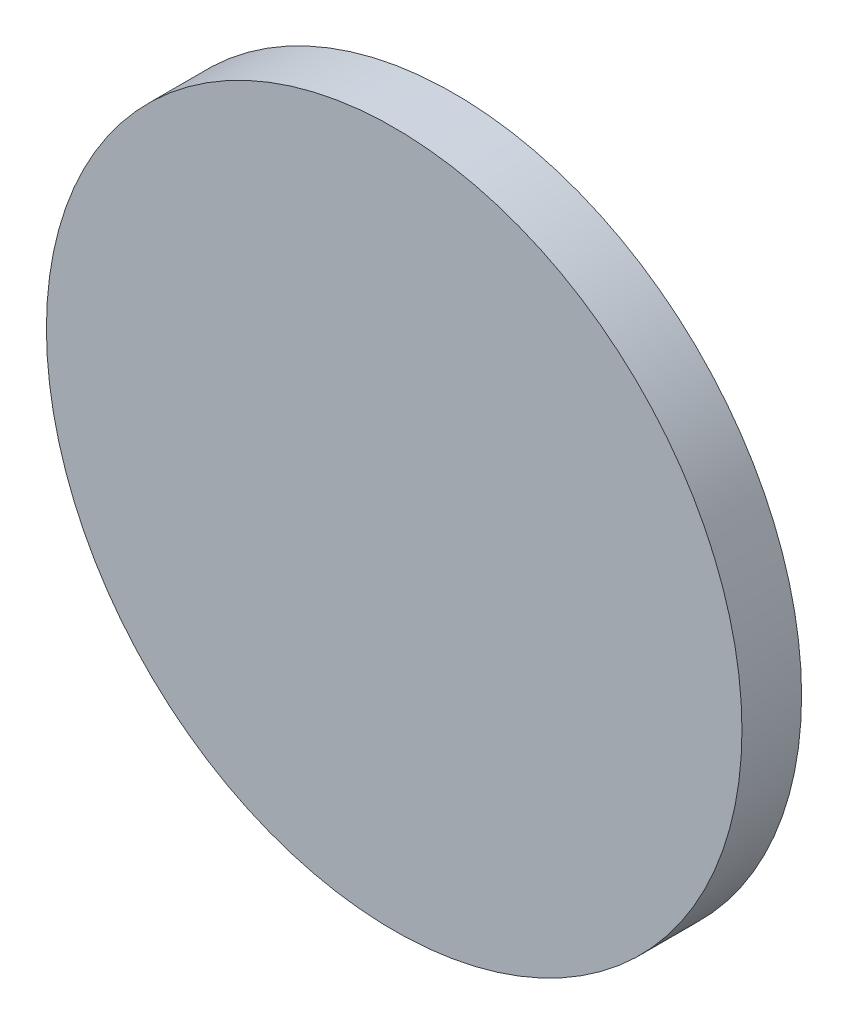
ISO-10303-21;
HEADER;
FILE_DESCRIPTION(('STEP AP214'),'2;1');
FILE_NAME('part.step','',(''),(''),'','','');
FILE_SCHEMA(('AUTOMOTIVE_DESIGN { 1 0 10303 214 1 1 1 1 }'));
ENDSEC;
DATA;
#1=APPLICATION_CONTEXT('core data for automotive mechanical design processes');
#2=APPLICATION_PROTOCOL_DEFINITION('international standard','automotive_design',2000,#1);
#3=PRODUCT_CONTEXT('',#1,'mechanical');
#4=PRODUCT('Part','Part','',(#3));
#5=PRODUCT_RELATED_PRODUCT_CATEGORY('part','',(#4));
#6=PRODUCT_DEFINITION_FORMATION('','',#4);
#7=PRODUCT_DEFINITION_CONTEXT('part definition',#1,'design');
#8=PRODUCT_DEFINITION('design','',#6,#7);
#9=PRODUCT_DEFINITION_SHAPE('','',#8);
#10=(LENGTH_UNIT() NAMED_UNIT(*) SI_UNIT(.MILLI.,.METRE.));
#11=(NAMED_UNIT(*) PLANE_ANGLE_UNIT() SI_UNIT($,.RADIAN.));
#12=(NAMED_UNIT(*) SI_UNIT($,.STERADIAN.) SOLID_ANGLE_UNIT());
#13=UNCERTAINTY_MEASURE_WITH_UNIT(LENGTH_MEASURE(1.E-05),#10,'distance_accuracy_value','');
#14=(GEOMETRIC_REPRESENTATION_CONTEXT(3) GLOBAL_UNCERTAINTY_ASSIGNED_CONTEXT((#13)) GLOBAL_UNIT_ASSIGNED_CONTEXT((#10,
#11,#12)) REPRESENTATION_CONTEXT('',''));
#15=CARTESIAN_POINT('',(0.,0.,0.));
#16=DIRECTION('',(0.,0.,1.));
#17=DIRECTION('',(1.,0.,0.));
#18=AXIS2_PLACEMENT_3D('',#15,#16,#17);
#19=CARTESIAN_POINT('',(1.7399,3.710940006176,0.));
#20=DIRECTION('',(0.,0.,-1.));
#21=DIRECTION('',(-1.,0.,0.));
#22=AXIS2_PLACEMENT_3D('',#19,#20,#21);
#23=PLANE('',#22);
#24=CARTESIAN_POINT('',(1.7399,3.710940006176,0.));
#25=DIRECTION('',(0.,0.,1.));
#26=DIRECTION('',(1.,0.,0.));
#27=AXIS2_PLACEMENT_3D('',#24,#25,#26);
#28=CIRCLE('',#27,0.200024667);
#29=CARTESIAN_POINT('',(1.939924667,3.710940006176,0.));
#30=VERTEX_POINT('',#29);
#31=EDGE_CURVE('E18',#30,#30,#28,.T.);
#32=ORIENTED_EDGE('',*,*,#31,.F.);
#33=EDGE_LOOP('',(#32));
#34=FACE_BOUND('',#33,.T.);
#35=ADVANCED_FACE('F15',(#34),#23,.T.);
#36=CARTESIAN_POINT('',(1.7399,3.710940006176,0.));
#37=DIRECTION('',(0.,0.,1.));
#38=DIRECTION('',(1.,0.,0.));
#39=AXIS2_PLACEMENT_3D('',#36,#37,#38);
#40=CYLINDRICAL_SURFACE('',#39,0.200024667);
#41=CARTESIAN_POINT('',(1.7399,3.710940006176,0.03429));
#42=DIRECTION('',(0.,0.,1.));
#43=DIRECTION('',(1.,0.,0.));
#44=AXIS2_PLACEMENT_3D('',#41,#42,#43);
#45=CIRCLE('',#44,0.200024667);
#46=CARTESIAN_POINT('',(1.939924667,3.710940006176,0.03429));
#47=VERTEX_POINT('',#46);
#48=EDGE_CURVE('E10',#47,#47,#45,.T.);
#49=ORIENTED_EDGE('',*,*,#48,.F.);
#50=EDGE_LOOP('',(#49));
#51=FACE_BOUND('',#50,.T.);
#52=ORIENTED_EDGE('',*,*,#31,.T.);
#53=EDGE_LOOP('',(#52));
#54=FACE_BOUND('',#53,.T.);
#55=ADVANCED_FACE('F27',(#51,#54),#40,.T.);
#56=CARTESIAN_POINT('',(1.7399,3.710940006176,0.03429));
#57=DIRECTION('',(0.,0.,1.));
#58=DIRECTION('',(1.,0.,0.));
#59=AXIS2_PLACEMENT_3D('',#56,#57,#58);
#60=PLANE('',#59);
#61=ORIENTED_EDGE('',*,*,#48,.T.);
#62=EDGE_LOOP('',(#61));
#63=FACE_BOUND('',#62,.T.);
#64=ADVANCED_FACE('F34',(#63),#60,.T.);
#65=CLOSED_SHELL('',(#35,#55,#64));
#66=MANIFOLD_SOLID_BREP('B1',#65);
#67=ADVANCED_BREP_SHAPE_REPRESENTATION('',(#18,#66),#14);
#68=SHAPE_DEFINITION_REPRESENTATION(#9,#67);
ENDSEC;
END-ISO-10303-21;
